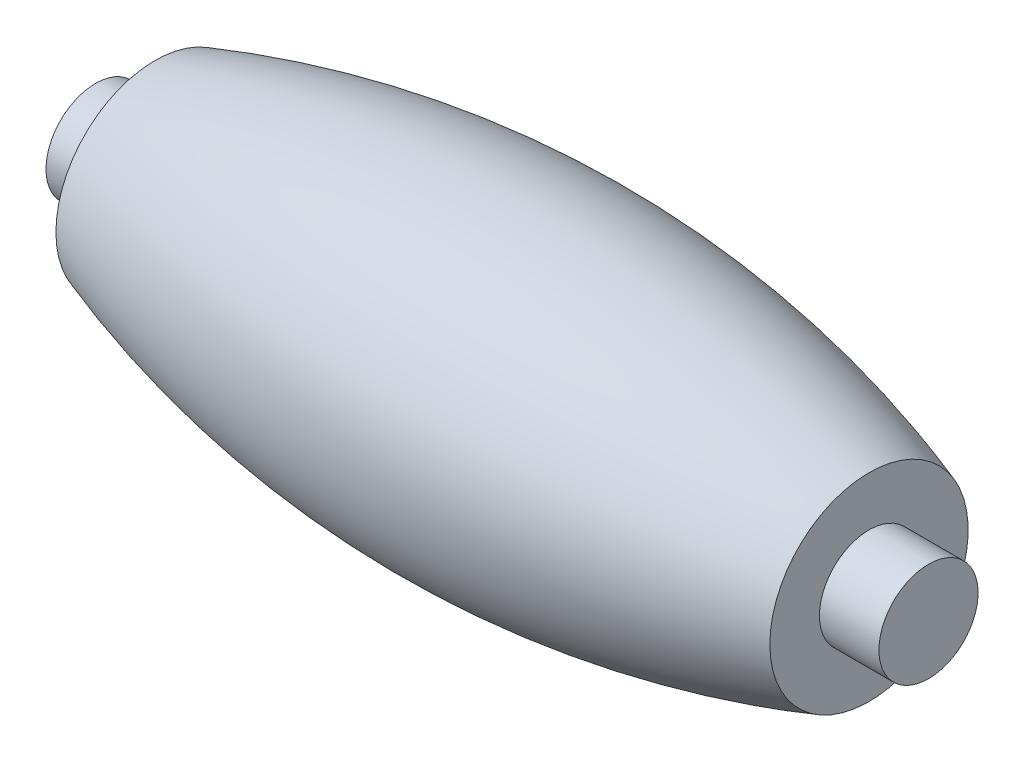
ISO-10303-21;
HEADER;
FILE_DESCRIPTION(('STEP AP214'),'2;1');
FILE_NAME('part.step','',(''),(''),'','','');
FILE_SCHEMA(('AUTOMOTIVE_DESIGN { 1 0 10303 214 1 1 1 1 }'));
ENDSEC;
DATA;
#1=APPLICATION_CONTEXT('core data for automotive mechanical design processes');
#2=APPLICATION_PROTOCOL_DEFINITION('international standard','automotive_design',2000,#1);
#3=PRODUCT_CONTEXT('',#1,'mechanical');
#4=PRODUCT('Part','Part','',(#3));
#5=PRODUCT_RELATED_PRODUCT_CATEGORY('part','',(#4));
#6=PRODUCT_DEFINITION_FORMATION('','',#4);
#7=PRODUCT_DEFINITION_CONTEXT('part definition',#1,'design');
#8=PRODUCT_DEFINITION('design','',#6,#7);
#9=PRODUCT_DEFINITION_SHAPE('','',#8);
#10=(LENGTH_UNIT() NAMED_UNIT(*) SI_UNIT(.MILLI.,.METRE.));
#11=(NAMED_UNIT(*) PLANE_ANGLE_UNIT() SI_UNIT($,.RADIAN.));
#12=(NAMED_UNIT(*) SI_UNIT($,.STERADIAN.) SOLID_ANGLE_UNIT());
#13=UNCERTAINTY_MEASURE_WITH_UNIT(LENGTH_MEASURE(1.E-05),#10,'distance_accuracy_value','');
#14=(GEOMETRIC_REPRESENTATION_CONTEXT(3) GLOBAL_UNCERTAINTY_ASSIGNED_CONTEXT((#13)) GLOBAL_UNIT_ASSIGNED_CONTEXT((#10,
#11,#12)) REPRESENTATION_CONTEXT('',''));
#15=CARTESIAN_POINT('',(0.,0.,0.));
#16=DIRECTION('',(0.,0.,1.));
#17=DIRECTION('',(1.,0.,0.));
#18=AXIS2_PLACEMENT_3D('',#15,#16,#17);
#19=CARTESIAN_POINT('',(0.,0.,0.));
#20=DIRECTION('',(1.,0.,0.));
#21=DIRECTION('',(0.,0.,-1.));
#22=AXIS2_PLACEMENT_3D('',#19,#20,#21);
#23=PLANE('',#22);
#24=CARTESIAN_POINT('',(0.,0.,0.));
#25=DIRECTION('',(-1.,0.,0.));
#26=DIRECTION('',(0.,0.,1.));
#27=AXIS2_PLACEMENT_3D('',#24,#25,#26);
#28=CIRCLE('',#27,2.5);
#29=CARTESIAN_POINT('',(0.,0.,2.5));
#30=VERTEX_POINT('',#29);
#31=EDGE_CURVE('E10',#30,#30,#28,.T.);
#32=ORIENTED_EDGE('',*,*,#31,.T.);
#33=EDGE_LOOP('',(#32));
#34=FACE_BOUND('',#33,.T.);
#35=ADVANCED_FACE('F32',(#34),#23,.F.);
#36=CARTESIAN_POINT('',(0.,0.,0.));
#37=DIRECTION('',(-1.,0.,0.));
#38=DIRECTION('',(0.,0.,1.));
#39=AXIS2_PLACEMENT_3D('',#36,#37,#38);
#40=CYLINDRICAL_SURFACE('',#39,2.5);
#41=ORIENTED_EDGE('',*,*,#31,.F.);
#42=EDGE_LOOP('',(#41));
#43=FACE_BOUND('',#42,.T.);
#44=CARTESIAN_POINT('',(3.,0.,0.));
#45=DIRECTION('',(-1.,0.,0.));
#46=DIRECTION('',(0.,0.,1.));
#47=AXIS2_PLACEMENT_3D('',#44,#45,#46);
#48=CIRCLE('',#47,2.5);
#49=CARTESIAN_POINT('',(3.,0.,2.5));
#50=VERTEX_POINT('',#49);
#51=EDGE_CURVE('E38',#50,#50,#48,.T.);
#52=ORIENTED_EDGE('',*,*,#51,.T.);
#53=EDGE_LOOP('',(#52));
#54=FACE_BOUND('',#53,.T.);
#55=ADVANCED_FACE('F70',(#43,#54),#40,.T.);
#56=CARTESIAN_POINT('',(3.,0.,-2.5));
#57=DIRECTION('',(1.,0.,0.));
#58=DIRECTION('',(0.,0.,-1.));
#59=AXIS2_PLACEMENT_3D('',#56,#57,#58);
#60=PLANE('',#59);
#61=ORIENTED_EDGE('',*,*,#51,.F.);
#62=EDGE_LOOP('',(#61));
#63=FACE_BOUND('',#62,.T.);
#64=CARTESIAN_POINT('',(3.,0.,0.));
#65=DIRECTION('',(-1.,0.,0.));
#66=DIRECTION('',(0.,0.,1.));
#67=AXIS2_PLACEMENT_3D('',#64,#65,#66);
#68=CIRCLE('',#67,5.);
#69=CARTESIAN_POINT('',(3.,0.,5.));
#70=VERTEX_POINT('',#69);
#71=EDGE_CURVE('E42',#70,#70,#68,.T.);
#72=ORIENTED_EDGE('',*,*,#71,.T.);
#73=EDGE_LOOP('',(#72));
#74=FACE_BOUND('',#73,.T.);
#75=ADVANCED_FACE('F74',(#63,#74),#60,.F.);
#76=CARTESIAN_POINT('',(21.,0.,0.));
#77=DIRECTION('',(-1.,0.,0.));
#78=DIRECTION('',(0.,0.,1.));
#79=AXIS2_PLACEMENT_3D('',#76,#77,#78);
#80=DEGENERATE_TOROIDAL_SURFACE('',#79,47.3352766397452,55.3442063901783,.F.);
#81=ORIENTED_EDGE('',*,*,#71,.F.);
#82=EDGE_LOOP('',(#81));
#83=FACE_BOUND('',#82,.T.);
#84=CARTESIAN_POINT('',(39.,0.,0.));
#85=DIRECTION('',(-1.,0.,0.));
#86=DIRECTION('',(0.,0.,1.));
#87=AXIS2_PLACEMENT_3D('',#84,#85,#86);
#88=CIRCLE('',#87,5.);
#89=CARTESIAN_POINT('',(39.,0.,5.));
#90=VERTEX_POINT('',#89);
#91=EDGE_CURVE('E46',#90,#90,#88,.T.);
#92=ORIENTED_EDGE('',*,*,#91,.T.);
#93=EDGE_LOOP('',(#92));
#94=FACE_BOUND('',#93,.T.);
#95=ADVANCED_FACE('F79',(#83,#94),#80,.F.);
#96=CARTESIAN_POINT('',(39.,0.,-2.5));
#97=DIRECTION('',(-1.,0.,0.));
#98=DIRECTION('',(0.,0.,1.));
#99=AXIS2_PLACEMENT_3D('',#96,#97,#98);
#100=PLANE('',#99);
#101=ORIENTED_EDGE('',*,*,#91,.F.);
#102=EDGE_LOOP('',(#101));
#103=FACE_BOUND('',#102,.T.);
#104=CARTESIAN_POINT('',(39.,0.,0.));
#105=DIRECTION('',(-1.,0.,0.));
#106=DIRECTION('',(0.,0.,1.));
#107=AXIS2_PLACEMENT_3D('',#104,#105,#106);
#108=CIRCLE('',#107,2.5);
#109=CARTESIAN_POINT('',(39.,0.,2.5));
#110=VERTEX_POINT('',#109);
#111=EDGE_CURVE('E51',#110,#110,#108,.T.);
#112=ORIENTED_EDGE('',*,*,#111,.T.);
#113=EDGE_LOOP('',(#112));
#114=FACE_BOUND('',#113,.T.);
#115=ADVANCED_FACE('F66',(#103,#114),#100,.F.);
#116=CARTESIAN_POINT('',(0.,0.,0.));
#117=DIRECTION('',(-1.,0.,0.));
#118=DIRECTION('',(0.,0.,1.));
#119=AXIS2_PLACEMENT_3D('',#116,#117,#118);
#120=CYLINDRICAL_SURFACE('',#119,2.5);
#121=ORIENTED_EDGE('',*,*,#111,.F.);
#122=EDGE_LOOP('',(#121));
#123=FACE_BOUND('',#122,.T.);
#124=CARTESIAN_POINT('',(42.,0.,0.));
#125=DIRECTION('',(-1.,0.,0.));
#126=DIRECTION('',(0.,0.,1.));
#127=AXIS2_PLACEMENT_3D('',#124,#125,#126);
#128=CIRCLE('',#127,2.5);
#129=CARTESIAN_POINT('',(42.,0.,2.5));
#130=VERTEX_POINT('',#129);
#131=EDGE_CURVE('E54',#130,#130,#128,.T.);
#132=ORIENTED_EDGE('',*,*,#131,.T.);
#133=EDGE_LOOP('',(#132));
#134=FACE_BOUND('',#133,.T.);
#135=ADVANCED_FACE('F58',(#123,#134),#120,.T.);
#136=CARTESIAN_POINT('',(42.,0.,0.));
#137=DIRECTION('',(-1.,0.,0.));
#138=DIRECTION('',(0.,0.,1.));
#139=AXIS2_PLACEMENT_3D('',#136,#137,#138);
#140=PLANE('',#139);
#141=ORIENTED_EDGE('',*,*,#131,.F.);
#142=EDGE_LOOP('',(#141));
#143=FACE_BOUND('',#142,.T.);
#144=ADVANCED_FACE('F60',(#143),#140,.F.);
#145=CLOSED_SHELL('',(#35,#55,#75,#95,#115,#135,#144));
#146=MANIFOLD_SOLID_BREP('B2',#145);
#147=ADVANCED_BREP_SHAPE_REPRESENTATION('',(#18,#146),#14);
#148=SHAPE_DEFINITION_REPRESENTATION(#9,#147);
ENDSEC;
END-ISO-10303-21;
